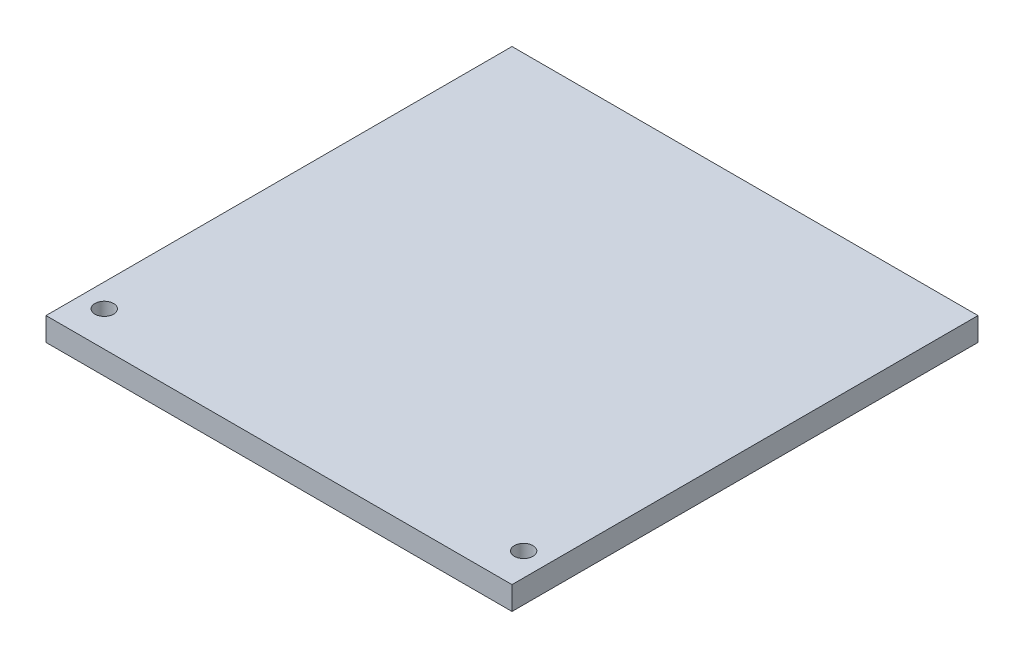
ISO-10303-21;
HEADER;
FILE_DESCRIPTION(('STEP AP214'),'2;1');
FILE_NAME('part.step','',(''),(''),'','','');
FILE_SCHEMA(('AUTOMOTIVE_DESIGN { 1 0 10303 214 1 1 1 1 }'));
ENDSEC;
DATA;
#1=APPLICATION_CONTEXT('core data for automotive mechanical design processes');
#2=APPLICATION_PROTOCOL_DEFINITION('international standard','automotive_design',2000,#1);
#3=PRODUCT_CONTEXT('',#1,'mechanical');
#4=PRODUCT('Part','Part','',(#3));
#5=PRODUCT_RELATED_PRODUCT_CATEGORY('part','',(#4));
#6=PRODUCT_DEFINITION_FORMATION('','',#4);
#7=PRODUCT_DEFINITION_CONTEXT('part definition',#1,'design');
#8=PRODUCT_DEFINITION('design','',#6,#7);
#9=PRODUCT_DEFINITION_SHAPE('','',#8);
#10=(LENGTH_UNIT() NAMED_UNIT(*) SI_UNIT(.MILLI.,.METRE.));
#11=(NAMED_UNIT(*) PLANE_ANGLE_UNIT() SI_UNIT($,.RADIAN.));
#12=(NAMED_UNIT(*) SI_UNIT($,.STERADIAN.) SOLID_ANGLE_UNIT());
#13=UNCERTAINTY_MEASURE_WITH_UNIT(LENGTH_MEASURE(1.E-05),#10,'distance_accuracy_value','');
#14=(GEOMETRIC_REPRESENTATION_CONTEXT(3) GLOBAL_UNCERTAINTY_ASSIGNED_CONTEXT((#13)) GLOBAL_UNIT_ASSIGNED_CONTEXT((#10,
#11,#12)) REPRESENTATION_CONTEXT('',''));
#15=CARTESIAN_POINT('',(0.,0.,0.));
#16=DIRECTION('',(0.,0.,1.));
#17=DIRECTION('',(1.,0.,0.));
#18=AXIS2_PLACEMENT_3D('',#15,#16,#17);
#19=CARTESIAN_POINT('',(100.,10.,100.));
#20=DIRECTION('',(-1.,0.,0.));
#21=DIRECTION('',(0.,0.,1.));
#22=AXIS2_PLACEMENT_3D('',#19,#20,#21);
#23=PLANE('',#22);
#24=DIRECTION('',(0.,0.,-1.));
#25=VECTOR('',#24,1.);
#26=CARTESIAN_POINT('',(100.,0.,100.));
#27=LINE('',#26,#25);
#28=CARTESIAN_POINT('',(100.,0.,100.));
#29=VERTEX_POINT('',#28);
#30=CARTESIAN_POINT('',(100.,0.,-100.));
#31=VERTEX_POINT('',#30);
#32=EDGE_CURVE('E148',#29,#31,#27,.T.);
#33=ORIENTED_EDGE('',*,*,#32,.T.);
#34=DIRECTION('',(0.,-1.,0.));
#35=VECTOR('',#34,1.);
#36=CARTESIAN_POINT('',(100.,10.,-100.));
#37=LINE('',#36,#35);
#38=CARTESIAN_POINT('',(100.,10.,-100.));
#39=VERTEX_POINT('',#38);
#40=EDGE_CURVE('E12',#39,#31,#37,.T.);
#41=ORIENTED_EDGE('',*,*,#40,.F.);
#42=DIRECTION('',(0.,0.,-1.));
#43=VECTOR('',#42,1.);
#44=CARTESIAN_POINT('',(100.,10.,100.));
#45=LINE('',#44,#43);
#46=CARTESIAN_POINT('',(100.,10.,100.));
#47=VERTEX_POINT('',#46);
#48=EDGE_CURVE('E98',#47,#39,#45,.T.);
#49=ORIENTED_EDGE('',*,*,#48,.F.);
#50=DIRECTION('',(0.,-1.,0.));
#51=VECTOR('',#50,1.);
#52=CARTESIAN_POINT('',(100.,10.,100.));
#53=LINE('',#52,#51);
#54=EDGE_CURVE('E110',#47,#29,#53,.T.);
#55=ORIENTED_EDGE('',*,*,#54,.T.);
#56=EDGE_LOOP('',(#33,#41,#49,#55));
#57=FACE_BOUND('',#56,.T.);
#58=ADVANCED_FACE('F45',(#57),#23,.F.);
#59=CARTESIAN_POINT('',(-100.,10.,-100.));
#60=DIRECTION('',(0.,0.,1.));
#61=DIRECTION('',(1.,0.,0.));
#62=AXIS2_PLACEMENT_3D('',#59,#60,#61);
#63=PLANE('',#62);
#64=DIRECTION('',(-1.,0.,0.));
#65=VECTOR('',#64,1.);
#66=CARTESIAN_POINT('',(-100.,0.,-100.));
#67=LINE('',#66,#65);
#68=CARTESIAN_POINT('',(-100.,0.,-100.));
#69=VERTEX_POINT('',#68);
#70=EDGE_CURVE('E103',#31,#69,#67,.T.);
#71=ORIENTED_EDGE('',*,*,#70,.T.);
#72=DIRECTION('',(0.,-1.,0.));
#73=VECTOR('',#72,1.);
#74=CARTESIAN_POINT('',(-100.,10.,-100.));
#75=LINE('',#74,#73);
#76=CARTESIAN_POINT('',(-100.,10.,-100.));
#77=VERTEX_POINT('',#76);
#78=EDGE_CURVE('E55',#77,#69,#75,.T.);
#79=ORIENTED_EDGE('',*,*,#78,.F.);
#80=DIRECTION('',(-1.,0.,0.));
#81=VECTOR('',#80,1.);
#82=CARTESIAN_POINT('',(-100.,10.,-100.));
#83=LINE('',#82,#81);
#84=EDGE_CURVE('E93',#39,#77,#83,.T.);
#85=ORIENTED_EDGE('',*,*,#84,.F.);
#86=ORIENTED_EDGE('',*,*,#40,.T.);
#87=EDGE_LOOP('',(#71,#79,#85,#86));
#88=FACE_BOUND('',#87,.T.);
#89=ADVANCED_FACE('F102',(#88),#63,.F.);
#90=CARTESIAN_POINT('',(-100.,10.,100.));
#91=DIRECTION('',(1.,0.,0.));
#92=DIRECTION('',(0.,0.,-1.));
#93=AXIS2_PLACEMENT_3D('',#90,#91,#92);
#94=PLANE('',#93);
#95=DIRECTION('',(0.,0.,1.));
#96=VECTOR('',#95,1.);
#97=CARTESIAN_POINT('',(-100.,0.,100.));
#98=LINE('',#97,#96);
#99=CARTESIAN_POINT('',(-100.,0.,100.));
#100=VERTEX_POINT('',#99);
#101=EDGE_CURVE('E80',#69,#100,#98,.T.);
#102=ORIENTED_EDGE('',*,*,#101,.T.);
#103=DIRECTION('',(0.,-1.,0.));
#104=VECTOR('',#103,1.);
#105=CARTESIAN_POINT('',(-100.,10.,100.));
#106=LINE('',#105,#104);
#107=CARTESIAN_POINT('',(-100.,10.,100.));
#108=VERTEX_POINT('',#107);
#109=EDGE_CURVE('E105',#108,#100,#106,.T.);
#110=ORIENTED_EDGE('',*,*,#109,.F.);
#111=DIRECTION('',(0.,0.,1.));
#112=VECTOR('',#111,1.);
#113=CARTESIAN_POINT('',(-100.,10.,100.));
#114=LINE('',#113,#112);
#115=EDGE_CURVE('E96',#77,#108,#114,.T.);
#116=ORIENTED_EDGE('',*,*,#115,.F.);
#117=ORIENTED_EDGE('',*,*,#78,.T.);
#118=EDGE_LOOP('',(#102,#110,#116,#117));
#119=FACE_BOUND('',#118,.T.);
#120=ADVANCED_FACE('F106',(#119),#94,.F.);
#121=CARTESIAN_POINT('',(-100.,10.,100.));
#122=DIRECTION('',(0.,0.,-1.));
#123=DIRECTION('',(-1.,0.,0.));
#124=AXIS2_PLACEMENT_3D('',#121,#122,#123);
#125=PLANE('',#124);
#126=DIRECTION('',(1.,0.,0.));
#127=VECTOR('',#126,1.);
#128=CARTESIAN_POINT('',(-100.,0.,100.));
#129=LINE('',#128,#127);
#130=EDGE_CURVE('E86',#100,#29,#129,.T.);
#131=ORIENTED_EDGE('',*,*,#130,.T.);
#132=ORIENTED_EDGE('',*,*,#54,.F.);
#133=DIRECTION('',(1.,0.,0.));
#134=VECTOR('',#133,1.);
#135=CARTESIAN_POINT('',(-100.,10.,100.));
#136=LINE('',#135,#134);
#137=EDGE_CURVE('E63',#108,#47,#136,.T.);
#138=ORIENTED_EDGE('',*,*,#137,.F.);
#139=ORIENTED_EDGE('',*,*,#109,.T.);
#140=EDGE_LOOP('',(#131,#132,#138,#139));
#141=FACE_BOUND('',#140,.T.);
#142=ADVANCED_FACE('F162',(#141),#125,.F.);
#143=CARTESIAN_POINT('',(0.,10.,0.));
#144=DIRECTION('',(0.,-1.,0.));
#145=DIRECTION('',(0.,0.,-1.));
#146=AXIS2_PLACEMENT_3D('',#143,#144,#145);
#147=PLANE('',#146);
#148=CARTESIAN_POINT('',(-90.,10.,85.));
#149=DIRECTION('',(0.,1.,0.));
#150=DIRECTION('',(0.,0.,1.));
#151=AXIS2_PLACEMENT_3D('',#148,#149,#150);
#152=CIRCLE('',#151,4.00000000000001);
#153=CARTESIAN_POINT('',(-90.,10.,89.));
#154=VERTEX_POINT('',#153);
#155=EDGE_CURVE('E137',#154,#154,#152,.T.);
#156=ORIENTED_EDGE('',*,*,#155,.F.);
#157=EDGE_LOOP('',(#156));
#158=FACE_BOUND('',#157,.T.);
#159=CARTESIAN_POINT('',(90.,10.,85.));
#160=DIRECTION('',(0.,1.,0.));
#161=DIRECTION('',(0.,0.,1.));
#162=AXIS2_PLACEMENT_3D('',#159,#160,#161);
#163=CIRCLE('',#162,4.00000000000001);
#164=CARTESIAN_POINT('',(90.,10.,89.));
#165=VERTEX_POINT('',#164);
#166=EDGE_CURVE('E127',#165,#165,#163,.T.);
#167=ORIENTED_EDGE('',*,*,#166,.F.);
#168=EDGE_LOOP('',(#167));
#169=FACE_BOUND('',#168,.T.);
#170=ORIENTED_EDGE('',*,*,#48,.T.);
#171=ORIENTED_EDGE('',*,*,#84,.T.);
#172=ORIENTED_EDGE('',*,*,#115,.T.);
#173=ORIENTED_EDGE('',*,*,#137,.T.);
#174=EDGE_LOOP('',(#170,#171,#172,#173));
#175=FACE_BOUND('',#174,.T.);
#176=ADVANCED_FACE('F94',(#158,#169,#175),#147,.F.);
#177=CARTESIAN_POINT('',(0.,0.,0.));
#178=DIRECTION('',(0.,-1.,0.));
#179=DIRECTION('',(0.,0.,-1.));
#180=AXIS2_PLACEMENT_3D('',#177,#178,#179);
#181=PLANE('',#180);
#182=CARTESIAN_POINT('',(-90.,0.,85.));
#183=DIRECTION('',(0.,1.,0.));
#184=DIRECTION('',(0.,0.,1.));
#185=AXIS2_PLACEMENT_3D('',#182,#183,#184);
#186=CIRCLE('',#185,4.00000000000001);
#187=CARTESIAN_POINT('',(-90.,0.,89.));
#188=VERTEX_POINT('',#187);
#189=EDGE_CURVE('E144',#188,#188,#186,.T.);
#190=ORIENTED_EDGE('',*,*,#189,.T.);
#191=EDGE_LOOP('',(#190));
#192=FACE_BOUND('',#191,.T.);
#193=CARTESIAN_POINT('',(90.,0.,85.));
#194=DIRECTION('',(0.,1.,0.));
#195=DIRECTION('',(0.,0.,1.));
#196=AXIS2_PLACEMENT_3D('',#193,#194,#195);
#197=CIRCLE('',#196,4.00000000000001);
#198=CARTESIAN_POINT('',(90.,0.,89.));
#199=VERTEX_POINT('',#198);
#200=EDGE_CURVE('E132',#199,#199,#197,.T.);
#201=ORIENTED_EDGE('',*,*,#200,.T.);
#202=EDGE_LOOP('',(#201));
#203=FACE_BOUND('',#202,.T.);
#204=ORIENTED_EDGE('',*,*,#32,.F.);
#205=ORIENTED_EDGE('',*,*,#130,.F.);
#206=ORIENTED_EDGE('',*,*,#101,.F.);
#207=ORIENTED_EDGE('',*,*,#70,.F.);
#208=EDGE_LOOP('',(#204,#205,#206,#207));
#209=FACE_BOUND('',#208,.T.);
#210=ADVANCED_FACE('F161',(#192,#203,#209),#181,.T.);
#211=CARTESIAN_POINT('',(90.,0.,85.));
#212=DIRECTION('',(0.,1.,0.));
#213=DIRECTION('',(0.,0.,1.));
#214=AXIS2_PLACEMENT_3D('',#211,#212,#213);
#215=CYLINDRICAL_SURFACE('',#214,4.00000000000001);
#216=ORIENTED_EDGE('',*,*,#200,.F.);
#217=EDGE_LOOP('',(#216));
#218=FACE_BOUND('',#217,.T.);
#219=ORIENTED_EDGE('',*,*,#166,.T.);
#220=EDGE_LOOP('',(#219));
#221=FACE_BOUND('',#220,.T.);
#222=ADVANCED_FACE('F166',(#218,#221),#215,.F.);
#223=CARTESIAN_POINT('',(-90.,0.,85.));
#224=DIRECTION('',(0.,1.,0.));
#225=DIRECTION('',(0.,0.,1.));
#226=AXIS2_PLACEMENT_3D('',#223,#224,#225);
#227=CYLINDRICAL_SURFACE('',#226,4.00000000000001);
#228=ORIENTED_EDGE('',*,*,#189,.F.);
#229=EDGE_LOOP('',(#228));
#230=FACE_BOUND('',#229,.T.);
#231=ORIENTED_EDGE('',*,*,#155,.T.);
#232=EDGE_LOOP('',(#231));
#233=FACE_BOUND('',#232,.T.);
#234=ADVANCED_FACE('F157',(#230,#233),#227,.F.);
#235=CLOSED_SHELL('',(#58,#89,#120,#142,#176,#210,#222,#234));
#236=MANIFOLD_SOLID_BREP('B2',#235);
#237=ADVANCED_BREP_SHAPE_REPRESENTATION('',(#18,#236),#14);
#238=SHAPE_DEFINITION_REPRESENTATION(#9,#237);
ENDSEC;
END-ISO-10303-21;
